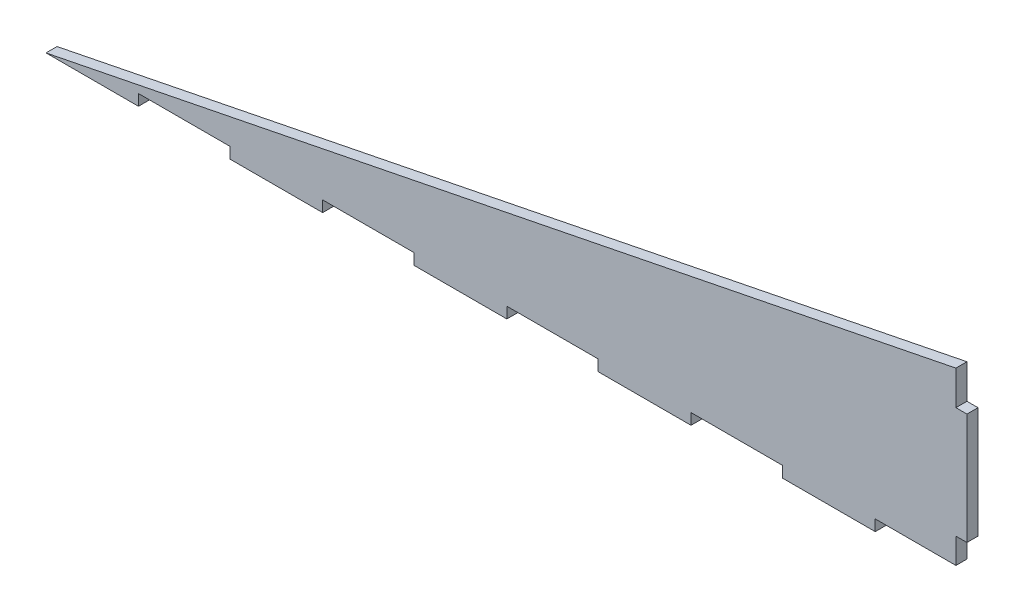
ISO-10303-21;
HEADER;
FILE_DESCRIPTION(('STEP AP214'),'2;1');
FILE_NAME('part.step','',(''),(''),'','','');
FILE_SCHEMA(('AUTOMOTIVE_DESIGN { 1 0 10303 214 1 1 1 1 }'));
ENDSEC;
DATA;
#1=APPLICATION_CONTEXT('core data for automotive mechanical design processes');
#2=APPLICATION_PROTOCOL_DEFINITION('international standard','automotive_design',2000,#1);
#3=PRODUCT_CONTEXT('',#1,'mechanical');
#4=PRODUCT('Part','Part','',(#3));
#5=PRODUCT_RELATED_PRODUCT_CATEGORY('part','',(#4));
#6=PRODUCT_DEFINITION_FORMATION('','',#4);
#7=PRODUCT_DEFINITION_CONTEXT('part definition',#1,'design');
#8=PRODUCT_DEFINITION('design','',#6,#7);
#9=PRODUCT_DEFINITION_SHAPE('','',#8);
#10=(LENGTH_UNIT() NAMED_UNIT(*) SI_UNIT(.MILLI.,.METRE.));
#11=(NAMED_UNIT(*) PLANE_ANGLE_UNIT() SI_UNIT($,.RADIAN.));
#12=(NAMED_UNIT(*) SI_UNIT($,.STERADIAN.) SOLID_ANGLE_UNIT());
#13=UNCERTAINTY_MEASURE_WITH_UNIT(LENGTH_MEASURE(1.E-05),#10,'distance_accuracy_value','');
#14=(GEOMETRIC_REPRESENTATION_CONTEXT(3) GLOBAL_UNCERTAINTY_ASSIGNED_CONTEXT((#13)) GLOBAL_UNIT_ASSIGNED_CONTEXT((#10,
#11,#12)) REPRESENTATION_CONTEXT('',''));
#15=CARTESIAN_POINT('',(0.,0.,0.));
#16=DIRECTION('',(0.,0.,1.));
#17=DIRECTION('',(1.,0.,0.));
#18=AXIS2_PLACEMENT_3D('',#15,#16,#17);
#19=CARTESIAN_POINT('',(225.1,0.,3.));
#20=DIRECTION('',(-1.,0.,0.));
#21=DIRECTION('',(0.,0.,1.));
#22=AXIS2_PLACEMENT_3D('',#19,#20,#21);
#23=PLANE('',#22);
#24=DIRECTION('',(0.,1.,0.));
#25=VECTOR('',#24,1.);
#26=CARTESIAN_POINT('',(225.1,0.,0.));
#27=LINE('',#26,#25);
#28=CARTESIAN_POINT('',(225.1,0.,0.));
#29=VERTEX_POINT('',#28);
#30=CARTESIAN_POINT('',(225.1,3.,0.));
#31=VERTEX_POINT('',#30);
#32=EDGE_CURVE('E245',#29,#31,#27,.T.);
#33=ORIENTED_EDGE('',*,*,#32,.T.);
#34=DIRECTION('',(0.,0.,-1.));
#35=VECTOR('',#34,1.);
#36=CARTESIAN_POINT('',(225.1,3.,3.));
#37=LINE('',#36,#35);
#38=CARTESIAN_POINT('',(225.1,3.,3.));
#39=VERTEX_POINT('',#38);
#40=EDGE_CURVE('E11',#39,#31,#37,.T.);
#41=ORIENTED_EDGE('',*,*,#40,.F.);
#42=DIRECTION('',(0.,1.,0.));
#43=VECTOR('',#42,1.);
#44=CARTESIAN_POINT('',(225.1,0.,3.));
#45=LINE('',#44,#43);
#46=CARTESIAN_POINT('',(225.1,0.,3.));
#47=VERTEX_POINT('',#46);
#48=EDGE_CURVE('E418',#47,#39,#45,.T.);
#49=ORIENTED_EDGE('',*,*,#48,.F.);
#50=DIRECTION('',(0.,0.,-1.));
#51=VECTOR('',#50,1.);
#52=CARTESIAN_POINT('',(225.1,0.,3.));
#53=LINE('',#52,#51);
#54=EDGE_CURVE('E239',#47,#29,#53,.T.);
#55=ORIENTED_EDGE('',*,*,#54,.T.);
#56=EDGE_LOOP('',(#33,#41,#49,#55));
#57=FACE_BOUND('',#56,.T.);
#58=ADVANCED_FACE('F41',(#57),#23,.F.);
#59=CARTESIAN_POINT('',(0.,3.,3.));
#60=DIRECTION('',(0.,1.,0.));
#61=DIRECTION('',(0.,0.,1.));
#62=AXIS2_PLACEMENT_3D('',#59,#60,#61);
#63=PLANE('',#62);
#64=DIRECTION('',(1.,0.,0.));
#65=VECTOR('',#64,1.);
#66=CARTESIAN_POINT('',(0.,3.,0.));
#67=LINE('',#66,#65);
#68=CARTESIAN_POINT('',(247.,3.,0.));
#69=VERTEX_POINT('',#68);
#70=EDGE_CURVE('E249',#31,#69,#67,.T.);
#71=ORIENTED_EDGE('',*,*,#70,.T.);
#72=DIRECTION('',(0.,0.,-1.));
#73=VECTOR('',#72,1.);
#74=CARTESIAN_POINT('',(247.,3.,3.));
#75=LINE('',#74,#73);
#76=CARTESIAN_POINT('',(247.,3.,3.));
#77=VERTEX_POINT('',#76);
#78=EDGE_CURVE('E50',#77,#69,#75,.T.);
#79=ORIENTED_EDGE('',*,*,#78,.F.);
#80=DIRECTION('',(1.,0.,0.));
#81=VECTOR('',#80,1.);
#82=CARTESIAN_POINT('',(0.,3.,3.));
#83=LINE('',#82,#81);
#84=EDGE_CURVE('E148',#39,#77,#83,.T.);
#85=ORIENTED_EDGE('',*,*,#84,.F.);
#86=ORIENTED_EDGE('',*,*,#40,.T.);
#87=EDGE_LOOP('',(#71,#79,#85,#86));
#88=FACE_BOUND('',#87,.T.);
#89=ADVANCED_FACE('F397',(#88),#63,.F.);
#90=CARTESIAN_POINT('',(247.,0.,3.));
#91=DIRECTION('',(1.,0.,0.));
#92=DIRECTION('',(0.,0.,-1.));
#93=AXIS2_PLACEMENT_3D('',#90,#91,#92);
#94=PLANE('',#93);
#95=DIRECTION('',(0.,-1.,0.));
#96=VECTOR('',#95,1.);
#97=CARTESIAN_POINT('',(247.,0.,0.));
#98=LINE('',#97,#96);
#99=CARTESIAN_POINT('',(247.,9.9,0.));
#100=VERTEX_POINT('',#99);
#101=EDGE_CURVE('E253',#100,#69,#98,.T.);
#102=ORIENTED_EDGE('',*,*,#101,.F.);
#103=DIRECTION('',(0.,0.,-1.));
#104=VECTOR('',#103,1.);
#105=CARTESIAN_POINT('',(247.,9.9,3.));
#106=LINE('',#105,#104);
#107=CARTESIAN_POINT('',(247.,9.9,3.));
#108=VERTEX_POINT('',#107);
#109=EDGE_CURVE('E388',#108,#100,#106,.T.);
#110=ORIENTED_EDGE('',*,*,#109,.F.);
#111=DIRECTION('',(0.,-1.,0.));
#112=VECTOR('',#111,1.);
#113=CARTESIAN_POINT('',(247.,0.,3.));
#114=LINE('',#113,#112);
#115=EDGE_CURVE('E396',#108,#77,#114,.T.);
#116=ORIENTED_EDGE('',*,*,#115,.T.);
#117=ORIENTED_EDGE('',*,*,#78,.T.);
#118=EDGE_LOOP('',(#102,#110,#116,#117));
#119=FACE_BOUND('',#118,.T.);
#120=ADVANCED_FACE('F394',(#119),#94,.T.);
#121=CARTESIAN_POINT('',(0.,9.90000000000014,3.));
#122=DIRECTION('',(0.,-1.,0.));
#123=DIRECTION('',(1.,0.,0.));
#124=AXIS2_PLACEMENT_3D('',#121,#122,#123);
#125=PLANE('',#124);
#126=DIRECTION('',(-1.,0.,0.));
#127=VECTOR('',#126,1.);
#128=CARTESIAN_POINT('',(0.,9.90000000000014,0.));
#129=LINE('',#128,#127);
#130=CARTESIAN_POINT('',(250.,9.9,0.));
#131=VERTEX_POINT('',#130);
#132=EDGE_CURVE('E257',#131,#100,#129,.T.);
#133=ORIENTED_EDGE('',*,*,#132,.F.);
#134=DIRECTION('',(0.,0.,-1.));
#135=VECTOR('',#134,1.);
#136=CARTESIAN_POINT('',(250.,9.9,3.));
#137=LINE('',#136,#135);
#138=CARTESIAN_POINT('',(250.,9.9,3.));
#139=VERTEX_POINT('',#138);
#140=EDGE_CURVE('E385',#139,#131,#137,.T.);
#141=ORIENTED_EDGE('',*,*,#140,.F.);
#142=DIRECTION('',(-1.,0.,0.));
#143=VECTOR('',#142,1.);
#144=CARTESIAN_POINT('',(0.,9.90000000000014,3.));
#145=LINE('',#144,#143);
#146=EDGE_CURVE('E410',#139,#108,#145,.T.);
#147=ORIENTED_EDGE('',*,*,#146,.T.);
#148=ORIENTED_EDGE('',*,*,#109,.T.);
#149=EDGE_LOOP('',(#133,#141,#147,#148));
#150=FACE_BOUND('',#149,.T.);
#151=ADVANCED_FACE('F406',(#150),#125,.T.);
#152=CARTESIAN_POINT('',(250.,0.,3.));
#153=DIRECTION('',(-1.,0.,0.));
#154=DIRECTION('',(0.,0.,1.));
#155=AXIS2_PLACEMENT_3D('',#152,#153,#154);
#156=PLANE('',#155);
#157=DIRECTION('',(0.,1.,0.));
#158=VECTOR('',#157,1.);
#159=CARTESIAN_POINT('',(250.,0.,0.));
#160=LINE('',#159,#158);
#161=CARTESIAN_POINT('',(250.,40.1,0.));
#162=VERTEX_POINT('',#161);
#163=EDGE_CURVE('E262',#131,#162,#160,.T.);
#164=ORIENTED_EDGE('',*,*,#163,.T.);
#165=DIRECTION('',(0.,0.,-1.));
#166=VECTOR('',#165,1.);
#167=CARTESIAN_POINT('',(250.,40.1,3.));
#168=LINE('',#167,#166);
#169=CARTESIAN_POINT('',(250.,40.1,3.));
#170=VERTEX_POINT('',#169);
#171=EDGE_CURVE('E381',#170,#162,#168,.T.);
#172=ORIENTED_EDGE('',*,*,#171,.F.);
#173=DIRECTION('',(0.,1.,0.));
#174=VECTOR('',#173,1.);
#175=CARTESIAN_POINT('',(250.,0.,3.));
#176=LINE('',#175,#174);
#177=EDGE_CURVE('E416',#139,#170,#176,.T.);
#178=ORIENTED_EDGE('',*,*,#177,.F.);
#179=ORIENTED_EDGE('',*,*,#140,.T.);
#180=EDGE_LOOP('',(#164,#172,#178,#179));
#181=FACE_BOUND('',#180,.T.);
#182=ADVANCED_FACE('F535',(#181),#156,.F.);
#183=CARTESIAN_POINT('',(0.,40.1000000000006,3.));
#184=DIRECTION('',(0.,-1.,0.));
#185=DIRECTION('',(1.,0.,0.));
#186=AXIS2_PLACEMENT_3D('',#183,#184,#185);
#187=PLANE('',#186);
#188=DIRECTION('',(-1.,0.,0.));
#189=VECTOR('',#188,1.);
#190=CARTESIAN_POINT('',(0.,40.1000000000006,0.));
#191=LINE('',#190,#189);
#192=CARTESIAN_POINT('',(247.,40.1,0.));
#193=VERTEX_POINT('',#192);
#194=EDGE_CURVE('E265',#162,#193,#191,.T.);
#195=ORIENTED_EDGE('',*,*,#194,.T.);
#196=DIRECTION('',(0.,0.,-1.));
#197=VECTOR('',#196,1.);
#198=CARTESIAN_POINT('',(247.,40.1,3.));
#199=LINE('',#198,#197);
#200=CARTESIAN_POINT('',(247.,40.1,3.));
#201=VERTEX_POINT('',#200);
#202=EDGE_CURVE('E378',#201,#193,#199,.T.);
#203=ORIENTED_EDGE('',*,*,#202,.F.);
#204=DIRECTION('',(-1.,0.,0.));
#205=VECTOR('',#204,1.);
#206=CARTESIAN_POINT('',(0.,40.1000000000006,3.));
#207=LINE('',#206,#205);
#208=EDGE_CURVE('E423',#170,#201,#207,.T.);
#209=ORIENTED_EDGE('',*,*,#208,.F.);
#210=ORIENTED_EDGE('',*,*,#171,.T.);
#211=EDGE_LOOP('',(#195,#203,#209,#210));
#212=FACE_BOUND('',#211,.T.);
#213=ADVANCED_FACE('F532',(#212),#187,.F.);
#214=CARTESIAN_POINT('',(247.,49.4,0.));
#215=VERTEX_POINT('',#214);
#216=EDGE_CURVE('E258',#215,#193,#98,.T.);
#217=ORIENTED_EDGE('',*,*,#216,.F.);
#218=DIRECTION('',(0.,0.,-1.));
#219=VECTOR('',#218,1.);
#220=CARTESIAN_POINT('',(247.,49.4,3.));
#221=LINE('',#220,#219);
#222=CARTESIAN_POINT('',(247.,49.4,3.));
#223=VERTEX_POINT('',#222);
#224=EDGE_CURVE('E375',#223,#215,#221,.T.);
#225=ORIENTED_EDGE('',*,*,#224,.F.);
#226=EDGE_CURVE('E413',#223,#201,#114,.T.);
#227=ORIENTED_EDGE('',*,*,#226,.T.);
#228=ORIENTED_EDGE('',*,*,#202,.T.);
#229=EDGE_LOOP('',(#217,#225,#227,#228));
#230=FACE_BOUND('',#229,.T.);
#231=ADVANCED_FACE('F530',(#230),#94,.T.);
#232=CARTESIAN_POINT('',(0.,0.,3.));
#233=DIRECTION('',(-0.196116135138184,0.98058067569092,0.));
#234=DIRECTION('',(-0.98058067569092,-0.196116135138184,0.));
#235=AXIS2_PLACEMENT_3D('',#232,#233,#234);
#236=PLANE('',#235);
#237=DIRECTION('',(0.98058067569092,0.196116135138184,0.));
#238=VECTOR('',#237,1.);
#239=CARTESIAN_POINT('',(0.,0.,0.));
#240=LINE('',#239,#238);
#241=CARTESIAN_POINT('',(0.,0.,0.));
#242=VERTEX_POINT('',#241);
#243=EDGE_CURVE('E269',#242,#215,#240,.T.);
#244=ORIENTED_EDGE('',*,*,#243,.F.);
#245=DIRECTION('',(0.,0.,-1.));
#246=VECTOR('',#245,1.);
#247=CARTESIAN_POINT('',(0.,0.,3.));
#248=LINE('',#247,#246);
#249=CARTESIAN_POINT('',(0.,0.,3.));
#250=VERTEX_POINT('',#249);
#251=EDGE_CURVE('E372',#250,#242,#248,.T.);
#252=ORIENTED_EDGE('',*,*,#251,.F.);
#253=DIRECTION('',(0.98058067569092,0.196116135138184,0.));
#254=VECTOR('',#253,1.);
#255=CARTESIAN_POINT('',(0.,0.,3.));
#256=LINE('',#255,#254);
#257=EDGE_CURVE('E422',#250,#223,#256,.T.);
#258=ORIENTED_EDGE('',*,*,#257,.T.);
#259=ORIENTED_EDGE('',*,*,#224,.T.);
#260=EDGE_LOOP('',(#244,#252,#258,#259));
#261=FACE_BOUND('',#260,.T.);
#262=ADVANCED_FACE('F563',(#261),#236,.T.);
#263=CARTESIAN_POINT('',(0.,0.,3.));
#264=DIRECTION('',(0.,1.,0.));
#265=DIRECTION('',(0.,0.,1.));
#266=AXIS2_PLACEMENT_3D('',#263,#264,#265);
#267=PLANE('',#266);
#268=DIRECTION('',(1.,0.,0.));
#269=VECTOR('',#268,1.);
#270=CARTESIAN_POINT('',(0.,0.,0.));
#271=LINE('',#270,#269);
#272=CARTESIAN_POINT('',(25.1,0.,0.));
#273=VERTEX_POINT('',#272);
#274=EDGE_CURVE('E273',#242,#273,#271,.T.);
#275=ORIENTED_EDGE('',*,*,#274,.T.);
#276=DIRECTION('',(0.,0.,-1.));
#277=VECTOR('',#276,1.);
#278=CARTESIAN_POINT('',(25.1,0.,3.));
#279=LINE('',#278,#277);
#280=CARTESIAN_POINT('',(25.1,0.,3.));
#281=VERTEX_POINT('',#280);
#282=EDGE_CURVE('E368',#281,#273,#279,.T.);
#283=ORIENTED_EDGE('',*,*,#282,.F.);
#284=DIRECTION('',(1.,0.,0.));
#285=VECTOR('',#284,1.);
#286=CARTESIAN_POINT('',(0.,0.,3.));
#287=LINE('',#286,#285);
#288=EDGE_CURVE('E242',#250,#281,#287,.T.);
#289=ORIENTED_EDGE('',*,*,#288,.F.);
#290=ORIENTED_EDGE('',*,*,#251,.T.);
#291=EDGE_LOOP('',(#275,#283,#289,#290));
#292=FACE_BOUND('',#291,.T.);
#293=ADVANCED_FACE('F553',(#292),#267,.F.);
#294=CARTESIAN_POINT('',(25.1,0.,3.));
#295=DIRECTION('',(-1.,0.,0.));
#296=DIRECTION('',(0.,0.,1.));
#297=AXIS2_PLACEMENT_3D('',#294,#295,#296);
#298=PLANE('',#297);
#299=DIRECTION('',(0.,1.,0.));
#300=VECTOR('',#299,1.);
#301=CARTESIAN_POINT('',(25.1,0.,0.));
#302=LINE('',#301,#300);
#303=CARTESIAN_POINT('',(25.1,3.,0.));
#304=VERTEX_POINT('',#303);
#305=EDGE_CURVE('E276',#273,#304,#302,.T.);
#306=ORIENTED_EDGE('',*,*,#305,.T.);
#307=DIRECTION('',(0.,0.,-1.));
#308=VECTOR('',#307,1.);
#309=CARTESIAN_POINT('',(25.1,3.,3.));
#310=LINE('',#309,#308);
#311=CARTESIAN_POINT('',(25.1,3.,3.));
#312=VERTEX_POINT('',#311);
#313=EDGE_CURVE('E364',#312,#304,#310,.T.);
#314=ORIENTED_EDGE('',*,*,#313,.F.);
#315=DIRECTION('',(0.,1.,0.));
#316=VECTOR('',#315,1.);
#317=CARTESIAN_POINT('',(25.1,0.,3.));
#318=LINE('',#317,#316);
#319=EDGE_CURVE('E437',#281,#312,#318,.T.);
#320=ORIENTED_EDGE('',*,*,#319,.F.);
#321=ORIENTED_EDGE('',*,*,#282,.T.);
#322=EDGE_LOOP('',(#306,#314,#320,#321));
#323=FACE_BOUND('',#322,.T.);
#324=ADVANCED_FACE('F562',(#323),#298,.F.);
#325=CARTESIAN_POINT('',(0.,3.,3.));
#326=DIRECTION('',(0.,1.,0.));
#327=DIRECTION('',(0.,0.,1.));
#328=AXIS2_PLACEMENT_3D('',#325,#326,#327);
#329=PLANE('',#328);
#330=DIRECTION('',(1.,0.,0.));
#331=VECTOR('',#330,1.);
#332=CARTESIAN_POINT('',(0.,3.,0.));
#333=LINE('',#332,#331);
#334=CARTESIAN_POINT('',(49.9,3.,0.));
#335=VERTEX_POINT('',#334);
#336=EDGE_CURVE('E280',#304,#335,#333,.T.);
#337=ORIENTED_EDGE('',*,*,#336,.T.);
#338=DIRECTION('',(0.,0.,-1.));
#339=VECTOR('',#338,1.);
#340=CARTESIAN_POINT('',(49.9,3.,3.));
#341=LINE('',#340,#339);
#342=CARTESIAN_POINT('',(49.9,3.,3.));
#343=VERTEX_POINT('',#342);
#344=EDGE_CURVE('E361',#343,#335,#341,.T.);
#345=ORIENTED_EDGE('',*,*,#344,.F.);
#346=DIRECTION('',(1.,0.,0.));
#347=VECTOR('',#346,1.);
#348=CARTESIAN_POINT('',(0.,3.,3.));
#349=LINE('',#348,#347);
#350=EDGE_CURVE('E441',#312,#343,#349,.T.);
#351=ORIENTED_EDGE('',*,*,#350,.F.);
#352=ORIENTED_EDGE('',*,*,#313,.T.);
#353=EDGE_LOOP('',(#337,#345,#351,#352));
#354=FACE_BOUND('',#353,.T.);
#355=ADVANCED_FACE('F586',(#354),#329,.F.);
#356=CARTESIAN_POINT('',(49.9,0.,3.));
#357=DIRECTION('',(-1.,0.,0.));
#358=DIRECTION('',(0.,0.,1.));
#359=AXIS2_PLACEMENT_3D('',#356,#357,#358);
#360=PLANE('',#359);
#361=DIRECTION('',(0.,1.,0.));
#362=VECTOR('',#361,1.);
#363=CARTESIAN_POINT('',(49.9,0.,0.));
#364=LINE('',#363,#362);
#365=CARTESIAN_POINT('',(49.9,0.,0.));
#366=VERTEX_POINT('',#365);
#367=EDGE_CURVE('E284',#366,#335,#364,.T.);
#368=ORIENTED_EDGE('',*,*,#367,.F.);
#369=DIRECTION('',(0.,0.,-1.));
#370=VECTOR('',#369,1.);
#371=CARTESIAN_POINT('',(49.9,0.,3.));
#372=LINE('',#371,#370);
#373=CARTESIAN_POINT('',(49.9,0.,3.));
#374=VERTEX_POINT('',#373);
#375=EDGE_CURVE('E358',#374,#366,#372,.T.);
#376=ORIENTED_EDGE('',*,*,#375,.F.);
#377=DIRECTION('',(0.,1.,0.));
#378=VECTOR('',#377,1.);
#379=CARTESIAN_POINT('',(49.9,0.,3.));
#380=LINE('',#379,#378);
#381=EDGE_CURVE('E444',#374,#343,#380,.T.);
#382=ORIENTED_EDGE('',*,*,#381,.T.);
#383=ORIENTED_EDGE('',*,*,#344,.T.);
#384=EDGE_LOOP('',(#368,#376,#382,#383));
#385=FACE_BOUND('',#384,.T.);
#386=ADVANCED_FACE('F580',(#385),#360,.T.);
#387=CARTESIAN_POINT('',(75.1,0.,0.));
#388=VERTEX_POINT('',#387);
#389=EDGE_CURVE('E277',#366,#388,#271,.T.);
#390=ORIENTED_EDGE('',*,*,#389,.T.);
#391=DIRECTION('',(0.,0.,-1.));
#392=VECTOR('',#391,1.);
#393=CARTESIAN_POINT('',(75.1,0.,3.));
#394=LINE('',#393,#392);
#395=CARTESIAN_POINT('',(75.1,0.,3.));
#396=VERTEX_POINT('',#395);
#397=EDGE_CURVE('E354',#396,#388,#394,.T.);
#398=ORIENTED_EDGE('',*,*,#397,.F.);
#399=EDGE_CURVE('E438',#374,#396,#287,.T.);
#400=ORIENTED_EDGE('',*,*,#399,.F.);
#401=ORIENTED_EDGE('',*,*,#375,.T.);
#402=EDGE_LOOP('',(#390,#398,#400,#401));
#403=FACE_BOUND('',#402,.T.);
#404=ADVANCED_FACE('F484',(#403),#267,.F.);
#405=CARTESIAN_POINT('',(75.1,0.,3.));
#406=DIRECTION('',(-1.,0.,0.));
#407=DIRECTION('',(0.,0.,1.));
#408=AXIS2_PLACEMENT_3D('',#405,#406,#407);
#409=PLANE('',#408);
#410=DIRECTION('',(0.,1.,0.));
#411=VECTOR('',#410,1.);
#412=CARTESIAN_POINT('',(75.1,0.,0.));
#413=LINE('',#412,#411);
#414=CARTESIAN_POINT('',(75.1,3.,0.));
#415=VERTEX_POINT('',#414);
#416=EDGE_CURVE('E288',#388,#415,#413,.T.);
#417=ORIENTED_EDGE('',*,*,#416,.T.);
#418=DIRECTION('',(0.,0.,-1.));
#419=VECTOR('',#418,1.);
#420=CARTESIAN_POINT('',(75.1,3.,3.));
#421=LINE('',#420,#419);
#422=CARTESIAN_POINT('',(75.1,3.,3.));
#423=VERTEX_POINT('',#422);
#424=EDGE_CURVE('E350',#423,#415,#421,.T.);
#425=ORIENTED_EDGE('',*,*,#424,.F.);
#426=DIRECTION('',(0.,1.,0.));
#427=VECTOR('',#426,1.);
#428=CARTESIAN_POINT('',(75.1,0.,3.));
#429=LINE('',#428,#427);
#430=EDGE_CURVE('E448',#396,#423,#429,.T.);
#431=ORIENTED_EDGE('',*,*,#430,.F.);
#432=ORIENTED_EDGE('',*,*,#397,.T.);
#433=EDGE_LOOP('',(#417,#425,#431,#432));
#434=FACE_BOUND('',#433,.T.);
#435=ADVANCED_FACE('F488',(#434),#409,.F.);
#436=CARTESIAN_POINT('',(0.,3.,3.));
#437=DIRECTION('',(0.,1.,0.));
#438=DIRECTION('',(0.,0.,1.));
#439=AXIS2_PLACEMENT_3D('',#436,#437,#438);
#440=PLANE('',#439);
#441=DIRECTION('',(1.,0.,0.));
#442=VECTOR('',#441,1.);
#443=CARTESIAN_POINT('',(0.,3.,0.));
#444=LINE('',#443,#442);
#445=CARTESIAN_POINT('',(99.9,3.,0.));
#446=VERTEX_POINT('',#445);
#447=EDGE_CURVE('E291',#415,#446,#444,.T.);
#448=ORIENTED_EDGE('',*,*,#447,.T.);
#449=DIRECTION('',(0.,0.,-1.));
#450=VECTOR('',#449,1.);
#451=CARTESIAN_POINT('',(99.9,3.,3.));
#452=LINE('',#451,#450);
#453=CARTESIAN_POINT('',(99.9,3.,3.));
#454=VERTEX_POINT('',#453);
#455=EDGE_CURVE('E347',#454,#446,#452,.T.);
#456=ORIENTED_EDGE('',*,*,#455,.F.);
#457=DIRECTION('',(1.,0.,0.));
#458=VECTOR('',#457,1.);
#459=CARTESIAN_POINT('',(0.,3.,3.));
#460=LINE('',#459,#458);
#461=EDGE_CURVE('E451',#423,#454,#460,.T.);
#462=ORIENTED_EDGE('',*,*,#461,.F.);
#463=ORIENTED_EDGE('',*,*,#424,.T.);
#464=EDGE_LOOP('',(#448,#456,#462,#463));
#465=FACE_BOUND('',#464,.T.);
#466=ADVANCED_FACE('F493',(#465),#440,.F.);
#467=CARTESIAN_POINT('',(99.9,0.,3.));
#468=DIRECTION('',(-1.,0.,0.));
#469=DIRECTION('',(0.,0.,1.));
#470=AXIS2_PLACEMENT_3D('',#467,#468,#469);
#471=PLANE('',#470);
#472=DIRECTION('',(0.,1.,0.));
#473=VECTOR('',#472,1.);
#474=CARTESIAN_POINT('',(99.9,0.,0.));
#475=LINE('',#474,#473);
#476=CARTESIAN_POINT('',(99.9,0.,0.));
#477=VERTEX_POINT('',#476);
#478=EDGE_CURVE('E295',#477,#446,#475,.T.);
#479=ORIENTED_EDGE('',*,*,#478,.F.);
#480=DIRECTION('',(0.,0.,-1.));
#481=VECTOR('',#480,1.);
#482=CARTESIAN_POINT('',(99.9,0.,3.));
#483=LINE('',#482,#481);
#484=CARTESIAN_POINT('',(99.9,0.,3.));
#485=VERTEX_POINT('',#484);
#486=EDGE_CURVE('E344',#485,#477,#483,.T.);
#487=ORIENTED_EDGE('',*,*,#486,.F.);
#488=DIRECTION('',(0.,1.,0.));
#489=VECTOR('',#488,1.);
#490=CARTESIAN_POINT('',(99.9,0.,3.));
#491=LINE('',#490,#489);
#492=EDGE_CURVE('E454',#485,#454,#491,.T.);
#493=ORIENTED_EDGE('',*,*,#492,.T.);
#494=ORIENTED_EDGE('',*,*,#455,.T.);
#495=EDGE_LOOP('',(#479,#487,#493,#494));
#496=FACE_BOUND('',#495,.T.);
#497=ADVANCED_FACE('F496',(#496),#471,.T.);
#498=CARTESIAN_POINT('',(125.1,0.,0.));
#499=VERTEX_POINT('',#498);
#500=EDGE_CURVE('E299',#477,#499,#271,.T.);
#501=ORIENTED_EDGE('',*,*,#500,.T.);
#502=DIRECTION('',(0.,0.,-1.));
#503=VECTOR('',#502,1.);
#504=CARTESIAN_POINT('',(125.1,0.,3.));
#505=LINE('',#504,#503);
#506=CARTESIAN_POINT('',(125.1,0.,3.));
#507=VERTEX_POINT('',#506);
#508=EDGE_CURVE('E340',#507,#499,#505,.T.);
#509=ORIENTED_EDGE('',*,*,#508,.F.);
#510=EDGE_CURVE('E458',#485,#507,#287,.T.);
#511=ORIENTED_EDGE('',*,*,#510,.F.);
#512=ORIENTED_EDGE('',*,*,#486,.T.);
#513=EDGE_LOOP('',(#501,#509,#511,#512));
#514=FACE_BOUND('',#513,.T.);
#515=ADVANCED_FACE('F499',(#514),#267,.F.);
#516=CARTESIAN_POINT('',(125.1,0.,3.));
#517=DIRECTION('',(-1.,0.,0.));
#518=DIRECTION('',(0.,0.,1.));
#519=AXIS2_PLACEMENT_3D('',#516,#517,#518);
#520=PLANE('',#519);
#521=DIRECTION('',(0.,1.,0.));
#522=VECTOR('',#521,1.);
#523=CARTESIAN_POINT('',(125.1,0.,0.));
#524=LINE('',#523,#522);
#525=CARTESIAN_POINT('',(125.1,3.,0.));
#526=VERTEX_POINT('',#525);
#527=EDGE_CURVE('E300',#499,#526,#524,.T.);
#528=ORIENTED_EDGE('',*,*,#527,.T.);
#529=DIRECTION('',(0.,0.,-1.));
#530=VECTOR('',#529,1.);
#531=CARTESIAN_POINT('',(125.1,3.,3.));
#532=LINE('',#531,#530);
#533=CARTESIAN_POINT('',(125.1,3.,3.));
#534=VERTEX_POINT('',#533);
#535=EDGE_CURVE('E336',#534,#526,#532,.T.);
#536=ORIENTED_EDGE('',*,*,#535,.F.);
#537=DIRECTION('',(0.,1.,0.));
#538=VECTOR('',#537,1.);
#539=CARTESIAN_POINT('',(125.1,0.,3.));
#540=LINE('',#539,#538);
#541=EDGE_CURVE('E459',#507,#534,#540,.T.);
#542=ORIENTED_EDGE('',*,*,#541,.F.);
#543=ORIENTED_EDGE('',*,*,#508,.T.);
#544=EDGE_LOOP('',(#528,#536,#542,#543));
#545=FACE_BOUND('',#544,.T.);
#546=ADVANCED_FACE('F504',(#545),#520,.F.);
#547=CARTESIAN_POINT('',(0.,3.,3.));
#548=DIRECTION('',(0.,1.,0.));
#549=DIRECTION('',(0.,0.,1.));
#550=AXIS2_PLACEMENT_3D('',#547,#548,#549);
#551=PLANE('',#550);
#552=DIRECTION('',(1.,0.,0.));
#553=VECTOR('',#552,1.);
#554=CARTESIAN_POINT('',(0.,3.,0.));
#555=LINE('',#554,#553);
#556=CARTESIAN_POINT('',(149.9,3.,0.));
#557=VERTEX_POINT('',#556);
#558=EDGE_CURVE('E303',#526,#557,#555,.T.);
#559=ORIENTED_EDGE('',*,*,#558,.T.);
#560=DIRECTION('',(0.,0.,-1.));
#561=VECTOR('',#560,1.);
#562=CARTESIAN_POINT('',(149.9,3.,3.));
#563=LINE('',#562,#561);
#564=CARTESIAN_POINT('',(149.9,3.,3.));
#565=VERTEX_POINT('',#564);
#566=EDGE_CURVE('E333',#565,#557,#563,.T.);
#567=ORIENTED_EDGE('',*,*,#566,.F.);
#568=DIRECTION('',(1.,0.,0.));
#569=VECTOR('',#568,1.);
#570=CARTESIAN_POINT('',(0.,3.,3.));
#571=LINE('',#570,#569);
#572=EDGE_CURVE('E462',#534,#565,#571,.T.);
#573=ORIENTED_EDGE('',*,*,#572,.F.);
#574=ORIENTED_EDGE('',*,*,#535,.T.);
#575=EDGE_LOOP('',(#559,#567,#573,#574));
#576=FACE_BOUND('',#575,.T.);
#577=ADVANCED_FACE('F508',(#576),#551,.F.);
#578=CARTESIAN_POINT('',(149.9,0.,3.));
#579=DIRECTION('',(-1.,0.,0.));
#580=DIRECTION('',(0.,0.,1.));
#581=AXIS2_PLACEMENT_3D('',#578,#579,#580);
#582=PLANE('',#581);
#583=DIRECTION('',(0.,1.,0.));
#584=VECTOR('',#583,1.);
#585=CARTESIAN_POINT('',(149.9,0.,0.));
#586=LINE('',#585,#584);
#587=CARTESIAN_POINT('',(149.9,0.,0.));
#588=VERTEX_POINT('',#587);
#589=EDGE_CURVE('E307',#588,#557,#586,.T.);
#590=ORIENTED_EDGE('',*,*,#589,.F.);
#591=DIRECTION('',(0.,0.,-1.));
#592=VECTOR('',#591,1.);
#593=CARTESIAN_POINT('',(149.9,0.,3.));
#594=LINE('',#593,#592);
#595=CARTESIAN_POINT('',(149.9,0.,3.));
#596=VERTEX_POINT('',#595);
#597=EDGE_CURVE('E330',#596,#588,#594,.T.);
#598=ORIENTED_EDGE('',*,*,#597,.F.);
#599=DIRECTION('',(0.,1.,0.));
#600=VECTOR('',#599,1.);
#601=CARTESIAN_POINT('',(149.9,0.,3.));
#602=LINE('',#601,#600);
#603=EDGE_CURVE('E465',#596,#565,#602,.T.);
#604=ORIENTED_EDGE('',*,*,#603,.T.);
#605=ORIENTED_EDGE('',*,*,#566,.T.);
#606=EDGE_LOOP('',(#590,#598,#604,#605));
#607=FACE_BOUND('',#606,.T.);
#608=ADVANCED_FACE('F512',(#607),#582,.T.);
#609=CARTESIAN_POINT('',(175.1,0.,0.));
#610=VERTEX_POINT('',#609);
#611=EDGE_CURVE('E311',#588,#610,#271,.T.);
#612=ORIENTED_EDGE('',*,*,#611,.T.);
#613=DIRECTION('',(0.,0.,-1.));
#614=VECTOR('',#613,1.);
#615=CARTESIAN_POINT('',(175.1,0.,3.));
#616=LINE('',#615,#614);
#617=CARTESIAN_POINT('',(175.1,0.,3.));
#618=VERTEX_POINT('',#617);
#619=EDGE_CURVE('E326',#618,#610,#616,.T.);
#620=ORIENTED_EDGE('',*,*,#619,.F.);
#621=EDGE_CURVE('E241',#596,#618,#287,.T.);
#622=ORIENTED_EDGE('',*,*,#621,.F.);
#623=ORIENTED_EDGE('',*,*,#597,.T.);
#624=EDGE_LOOP('',(#612,#620,#622,#623));
#625=FACE_BOUND('',#624,.T.);
#626=ADVANCED_FACE('F515',(#625),#267,.F.);
#627=CARTESIAN_POINT('',(175.1,0.,3.));
#628=DIRECTION('',(-1.,0.,0.));
#629=DIRECTION('',(0.,0.,1.));
#630=AXIS2_PLACEMENT_3D('',#627,#628,#629);
#631=PLANE('',#630);
#632=DIRECTION('',(0.,1.,0.));
#633=VECTOR('',#632,1.);
#634=CARTESIAN_POINT('',(175.1,0.,0.));
#635=LINE('',#634,#633);
#636=CARTESIAN_POINT('',(175.1,3.,0.));
#637=VERTEX_POINT('',#636);
#638=EDGE_CURVE('E312',#610,#637,#635,.T.);
#639=ORIENTED_EDGE('',*,*,#638,.T.);
#640=DIRECTION('',(0.,0.,-1.));
#641=VECTOR('',#640,1.);
#642=CARTESIAN_POINT('',(175.1,3.,3.));
#643=LINE('',#642,#641);
#644=CARTESIAN_POINT('',(175.1,3.,3.));
#645=VERTEX_POINT('',#644);
#646=EDGE_CURVE('E233',#645,#637,#643,.T.);
#647=ORIENTED_EDGE('',*,*,#646,.F.);
#648=DIRECTION('',(0.,1.,0.));
#649=VECTOR('',#648,1.);
#650=CARTESIAN_POINT('',(175.1,0.,3.));
#651=LINE('',#650,#649);
#652=EDGE_CURVE('E218',#618,#645,#651,.T.);
#653=ORIENTED_EDGE('',*,*,#652,.F.);
#654=ORIENTED_EDGE('',*,*,#619,.T.);
#655=EDGE_LOOP('',(#639,#647,#653,#654));
#656=FACE_BOUND('',#655,.T.);
#657=ADVANCED_FACE('F518',(#656),#631,.F.);
#658=CARTESIAN_POINT('',(0.,3.,3.));
#659=DIRECTION('',(0.,1.,0.));
#660=DIRECTION('',(0.,0.,1.));
#661=AXIS2_PLACEMENT_3D('',#658,#659,#660);
#662=PLANE('',#661);
#663=DIRECTION('',(1.,0.,0.));
#664=VECTOR('',#663,1.);
#665=CARTESIAN_POINT('',(0.,3.,0.));
#666=LINE('',#665,#664);
#667=CARTESIAN_POINT('',(199.9,3.,0.));
#668=VERTEX_POINT('',#667);
#669=EDGE_CURVE('E228',#637,#668,#666,.T.);
#670=ORIENTED_EDGE('',*,*,#669,.T.);
#671=DIRECTION('',(0.,0.,-1.));
#672=VECTOR('',#671,1.);
#673=CARTESIAN_POINT('',(199.9,3.,3.));
#674=LINE('',#673,#672);
#675=CARTESIAN_POINT('',(199.9,3.,3.));
#676=VERTEX_POINT('',#675);
#677=EDGE_CURVE('E225',#676,#668,#674,.T.);
#678=ORIENTED_EDGE('',*,*,#677,.F.);
#679=DIRECTION('',(1.,0.,0.));
#680=VECTOR('',#679,1.);
#681=CARTESIAN_POINT('',(0.,3.,3.));
#682=LINE('',#681,#680);
#683=EDGE_CURVE('E212',#645,#676,#682,.T.);
#684=ORIENTED_EDGE('',*,*,#683,.F.);
#685=ORIENTED_EDGE('',*,*,#646,.T.);
#686=EDGE_LOOP('',(#670,#678,#684,#685));
#687=FACE_BOUND('',#686,.T.);
#688=ADVANCED_FACE('F226',(#687),#662,.F.);
#689=CARTESIAN_POINT('',(199.9,0.,3.));
#690=DIRECTION('',(-1.,0.,0.));
#691=DIRECTION('',(0.,0.,1.));
#692=AXIS2_PLACEMENT_3D('',#689,#690,#691);
#693=PLANE('',#692);
#694=DIRECTION('',(0.,1.,0.));
#695=VECTOR('',#694,1.);
#696=CARTESIAN_POINT('',(199.9,0.,0.));
#697=LINE('',#696,#695);
#698=CARTESIAN_POINT('',(199.9,0.,0.));
#699=VERTEX_POINT('',#698);
#700=EDGE_CURVE('E317',#699,#668,#697,.T.);
#701=ORIENTED_EDGE('',*,*,#700,.F.);
#702=DIRECTION('',(0.,0.,-1.));
#703=VECTOR('',#702,1.);
#704=CARTESIAN_POINT('',(199.9,0.,3.));
#705=LINE('',#704,#703);
#706=CARTESIAN_POINT('',(199.9,0.,3.));
#707=VERTEX_POINT('',#706);
#708=EDGE_CURVE('E137',#707,#699,#705,.T.);
#709=ORIENTED_EDGE('',*,*,#708,.F.);
#710=DIRECTION('',(0.,1.,0.));
#711=VECTOR('',#710,1.);
#712=CARTESIAN_POINT('',(199.9,0.,3.));
#713=LINE('',#712,#711);
#714=EDGE_CURVE('E216',#707,#676,#713,.T.);
#715=ORIENTED_EDGE('',*,*,#714,.T.);
#716=ORIENTED_EDGE('',*,*,#677,.T.);
#717=EDGE_LOOP('',(#701,#709,#715,#716));
#718=FACE_BOUND('',#717,.T.);
#719=ADVANCED_FACE('F235',(#718),#693,.T.);
#720=EDGE_CURVE('E140',#699,#29,#271,.T.);
#721=ORIENTED_EDGE('',*,*,#720,.T.);
#722=ORIENTED_EDGE('',*,*,#54,.F.);
#723=EDGE_CURVE('E58',#707,#47,#287,.T.);
#724=ORIENTED_EDGE('',*,*,#723,.F.);
#725=ORIENTED_EDGE('',*,*,#708,.T.);
#726=EDGE_LOOP('',(#721,#722,#724,#725));
#727=FACE_BOUND('',#726,.T.);
#728=ADVANCED_FACE('F550',(#727),#267,.F.);
#729=CARTESIAN_POINT('',(0.,0.,3.));
#730=DIRECTION('',(0.,0.,1.));
#731=DIRECTION('',(1.,0.,0.));
#732=AXIS2_PLACEMENT_3D('',#729,#730,#731);
#733=PLANE('',#732);
#734=ORIENTED_EDGE('',*,*,#48,.T.);
#735=ORIENTED_EDGE('',*,*,#84,.T.);
#736=ORIENTED_EDGE('',*,*,#115,.F.);
#737=ORIENTED_EDGE('',*,*,#146,.F.);
#738=ORIENTED_EDGE('',*,*,#177,.T.);
#739=ORIENTED_EDGE('',*,*,#208,.T.);
#740=ORIENTED_EDGE('',*,*,#226,.F.);
#741=ORIENTED_EDGE('',*,*,#257,.F.);
#742=ORIENTED_EDGE('',*,*,#288,.T.);
#743=ORIENTED_EDGE('',*,*,#319,.T.);
#744=ORIENTED_EDGE('',*,*,#350,.T.);
#745=ORIENTED_EDGE('',*,*,#381,.F.);
#746=ORIENTED_EDGE('',*,*,#399,.T.);
#747=ORIENTED_EDGE('',*,*,#430,.T.);
#748=ORIENTED_EDGE('',*,*,#461,.T.);
#749=ORIENTED_EDGE('',*,*,#492,.F.);
#750=ORIENTED_EDGE('',*,*,#510,.T.);
#751=ORIENTED_EDGE('',*,*,#541,.T.);
#752=ORIENTED_EDGE('',*,*,#572,.T.);
#753=ORIENTED_EDGE('',*,*,#603,.F.);
#754=ORIENTED_EDGE('',*,*,#621,.T.);
#755=ORIENTED_EDGE('',*,*,#652,.T.);
#756=ORIENTED_EDGE('',*,*,#683,.T.);
#757=ORIENTED_EDGE('',*,*,#714,.F.);
#758=ORIENTED_EDGE('',*,*,#723,.T.);
#759=EDGE_LOOP('',(#734,#735,#736,#737,#738,#739,#740,#741,#742,#743,#744,#745,#746,#747,#748,
#749,#750,#751,#752,#753,#754,#755,#756,#757,#758));
#760=FACE_BOUND('',#759,.T.);
#761=ADVANCED_FACE('F214',(#760),#733,.T.);
#762=CARTESIAN_POINT('',(0.,0.,0.));
#763=DIRECTION('',(0.,0.,1.));
#764=DIRECTION('',(1.,0.,0.));
#765=AXIS2_PLACEMENT_3D('',#762,#763,#764);
#766=PLANE('',#765);
#767=ORIENTED_EDGE('',*,*,#32,.F.);
#768=ORIENTED_EDGE('',*,*,#720,.F.);
#769=ORIENTED_EDGE('',*,*,#700,.T.);
#770=ORIENTED_EDGE('',*,*,#669,.F.);
#771=ORIENTED_EDGE('',*,*,#638,.F.);
#772=ORIENTED_EDGE('',*,*,#611,.F.);
#773=ORIENTED_EDGE('',*,*,#589,.T.);
#774=ORIENTED_EDGE('',*,*,#558,.F.);
#775=ORIENTED_EDGE('',*,*,#527,.F.);
#776=ORIENTED_EDGE('',*,*,#500,.F.);
#777=ORIENTED_EDGE('',*,*,#478,.T.);
#778=ORIENTED_EDGE('',*,*,#447,.F.);
#779=ORIENTED_EDGE('',*,*,#416,.F.);
#780=ORIENTED_EDGE('',*,*,#389,.F.);
#781=ORIENTED_EDGE('',*,*,#367,.T.);
#782=ORIENTED_EDGE('',*,*,#336,.F.);
#783=ORIENTED_EDGE('',*,*,#305,.F.);
#784=ORIENTED_EDGE('',*,*,#274,.F.);
#785=ORIENTED_EDGE('',*,*,#243,.T.);
#786=ORIENTED_EDGE('',*,*,#216,.T.);
#787=ORIENTED_EDGE('',*,*,#194,.F.);
#788=ORIENTED_EDGE('',*,*,#163,.F.);
#789=ORIENTED_EDGE('',*,*,#132,.T.);
#790=ORIENTED_EDGE('',*,*,#101,.T.);
#791=ORIENTED_EDGE('',*,*,#70,.F.);
#792=EDGE_LOOP('',(#767,#768,#769,#770,#771,#772,#773,#774,#775,#776,#777,#778,#779,#780,#781,
#782,#783,#784,#785,#786,#787,#788,#789,#790,#791));
#793=FACE_BOUND('',#792,.T.);
#794=ADVANCED_FACE('F401',(#793),#766,.F.);
#795=CLOSED_SHELL('',(#58,#89,#120,#151,#182,#213,#231,#262,#293,#324,#355,#386,#404,#435,#466,
#497,#515,#546,#577,#608,#626,#657,#688,#719,#728,#761,#794));
#796=MANIFOLD_SOLID_BREP('B2',#795);
#797=ADVANCED_BREP_SHAPE_REPRESENTATION('',(#18,#796),#14);
#798=SHAPE_DEFINITION_REPRESENTATION(#9,#797);
ENDSEC;
END-ISO-10303-21;
